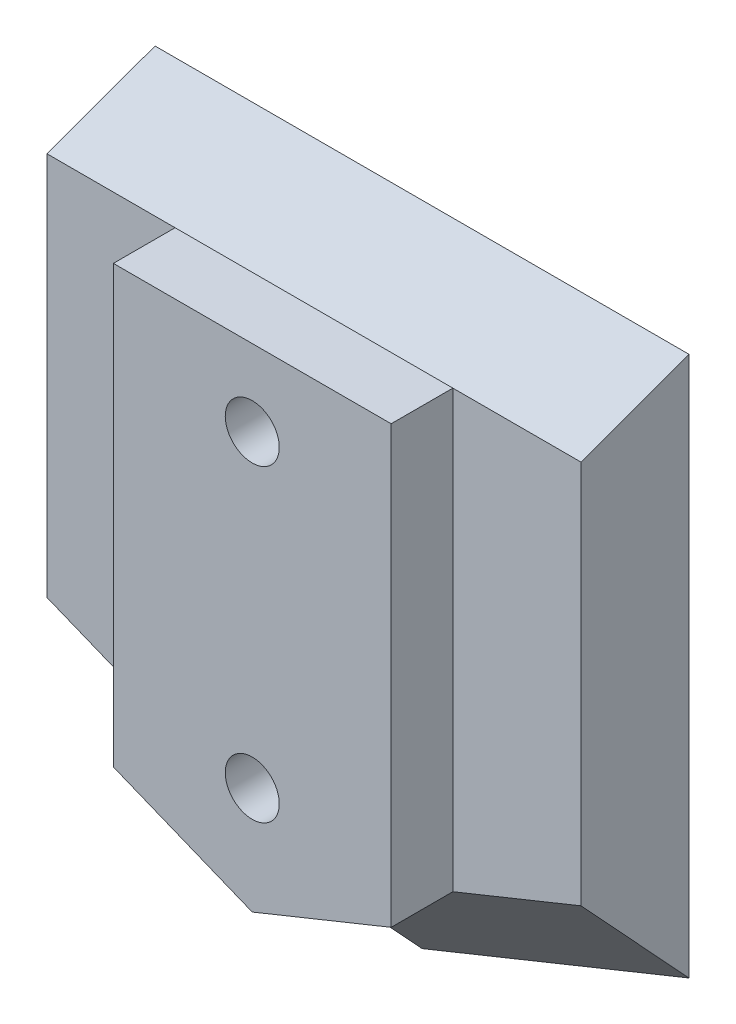
ISO-10303-21;
HEADER;
FILE_DESCRIPTION(('STEP AP214'),'2;1');
FILE_NAME('part.step','',(''),(''),'','','');
FILE_SCHEMA(('AUTOMOTIVE_DESIGN { 1 0 10303 214 1 1 1 1 }'));
ENDSEC;
DATA;
#1=APPLICATION_CONTEXT('core data for automotive mechanical design processes');
#2=APPLICATION_PROTOCOL_DEFINITION('international standard','automotive_design',2000,#1);
#3=PRODUCT_CONTEXT('',#1,'mechanical');
#4=PRODUCT('Part','Part','',(#3));
#5=PRODUCT_RELATED_PRODUCT_CATEGORY('part','',(#4));
#6=PRODUCT_DEFINITION_FORMATION('','',#4);
#7=PRODUCT_DEFINITION_CONTEXT('part definition',#1,'design');
#8=PRODUCT_DEFINITION('design','',#6,#7);
#9=PRODUCT_DEFINITION_SHAPE('','',#8);
#10=(LENGTH_UNIT() NAMED_UNIT(*) SI_UNIT(.MILLI.,.METRE.));
#11=(NAMED_UNIT(*) PLANE_ANGLE_UNIT() SI_UNIT($,.RADIAN.));
#12=(NAMED_UNIT(*) SI_UNIT($,.STERADIAN.) SOLID_ANGLE_UNIT());
#13=UNCERTAINTY_MEASURE_WITH_UNIT(LENGTH_MEASURE(1.E-05),#10,'distance_accuracy_value','');
#14=(GEOMETRIC_REPRESENTATION_CONTEXT(3) GLOBAL_UNCERTAINTY_ASSIGNED_CONTEXT((#13)) GLOBAL_UNIT_ASSIGNED_CONTEXT((#10,
#11,#12)) REPRESENTATION_CONTEXT('',''));
#15=CARTESIAN_POINT('',(0.,0.,0.));
#16=DIRECTION('',(0.,0.,1.));
#17=DIRECTION('',(1.,0.,0.));
#18=AXIS2_PLACEMENT_3D('',#15,#16,#17);
#19=CARTESIAN_POINT('',(0.,-12.,0.));
#20=DIRECTION('',(0.,0.,1.));
#21=DIRECTION('',(1.,0.,0.));
#22=AXIS2_PLACEMENT_3D('',#19,#20,#21);
#23=CYLINDRICAL_SURFACE('',#22,1.75);
#24=CARTESIAN_POINT('',(0.,-12.,11.));
#25=DIRECTION('',(0.,0.,1.));
#26=DIRECTION('',(-1.,0.,0.));
#27=AXIS2_PLACEMENT_3D('',#24,#25,#26);
#28=CIRCLE('',#27,1.75);
#29=CARTESIAN_POINT('',(-1.75,-12.,11.));
#30=VERTEX_POINT('',#29);
#31=EDGE_CURVE('E179',#30,#30,#28,.T.);
#32=ORIENTED_EDGE('',*,*,#31,.T.);
#33=EDGE_LOOP('',(#32));
#34=FACE_BOUND('',#33,.T.);
#35=CARTESIAN_POINT('',(0.,-12.,3.));
#36=DIRECTION('',(0.,0.,-1.));
#37=DIRECTION('',(-1.,0.,0.));
#38=AXIS2_PLACEMENT_3D('',#35,#36,#37);
#39=CIRCLE('',#38,1.75);
#40=CARTESIAN_POINT('',(-1.75,-12.,3.));
#41=VERTEX_POINT('',#40);
#42=EDGE_CURVE('E38',#41,#41,#39,.F.);
#43=ORIENTED_EDGE('',*,*,#42,.F.);
#44=EDGE_LOOP('',(#43));
#45=FACE_BOUND('',#44,.T.);
#46=ADVANCED_FACE('F34',(#34,#45),#23,.F.);
#47=CARTESIAN_POINT('',(0.,8.,0.));
#48=DIRECTION('',(0.,0.,1.));
#49=DIRECTION('',(1.,0.,0.));
#50=AXIS2_PLACEMENT_3D('',#47,#48,#49);
#51=CYLINDRICAL_SURFACE('',#50,1.75);
#52=CARTESIAN_POINT('',(0.,8.,11.));
#53=DIRECTION('',(0.,0.,1.));
#54=DIRECTION('',(-1.,0.,0.));
#55=AXIS2_PLACEMENT_3D('',#52,#53,#54);
#56=CIRCLE('',#55,1.75);
#57=CARTESIAN_POINT('',(-1.75,8.,11.));
#58=VERTEX_POINT('',#57);
#59=EDGE_CURVE('E174',#58,#58,#56,.T.);
#60=ORIENTED_EDGE('',*,*,#59,.T.);
#61=EDGE_LOOP('',(#60));
#62=FACE_BOUND('',#61,.T.);
#63=CARTESIAN_POINT('',(0.,8.,3.));
#64=DIRECTION('',(0.,0.,-1.));
#65=DIRECTION('',(-1.,0.,0.));
#66=AXIS2_PLACEMENT_3D('',#63,#64,#65);
#67=CIRCLE('',#66,1.75);
#68=CARTESIAN_POINT('',(-1.75,8.,3.));
#69=VERTEX_POINT('',#68);
#70=EDGE_CURVE('E172',#69,#69,#67,.F.);
#71=ORIENTED_EDGE('',*,*,#70,.F.);
#72=EDGE_LOOP('',(#71));
#73=FACE_BOUND('',#72,.T.);
#74=ADVANCED_FACE('F246',(#62,#73),#51,.F.);
#75=CARTESIAN_POINT('',(0.,0.,7.));
#76=DIRECTION('',(0.,0.,1.));
#77=DIRECTION('',(1.,0.,0.));
#78=AXIS2_PLACEMENT_3D('',#75,#76,#77);
#79=PLANE('',#78);
#80=DIRECTION('',(0.,-1.,0.));
#81=VECTOR('',#80,1.);
#82=CARTESIAN_POINT('',(-9.,12.9522083601366,7.));
#83=LINE('',#82,#81);
#84=CARTESIAN_POINT('',(-9.,12.9522083601366,7.));
#85=VERTEX_POINT('',#84);
#86=CARTESIAN_POINT('',(-9.,-15.3070690679913,7.));
#87=VERTEX_POINT('',#86);
#88=EDGE_CURVE('E203',#85,#87,#83,.T.);
#89=ORIENTED_EDGE('',*,*,#88,.F.);
#90=DIRECTION('',(-1.,0.,0.));
#91=VECTOR('',#90,1.);
#92=CARTESIAN_POINT('',(0.,12.9522083601366,7.));
#93=LINE('',#92,#91);
#94=CARTESIAN_POINT('',(-17.3,12.9522083601366,7.));
#95=VERTEX_POINT('',#94);
#96=EDGE_CURVE('E171',#85,#95,#93,.T.);
#97=ORIENTED_EDGE('',*,*,#96,.T.);
#98=DIRECTION('',(0.,-1.,0.));
#99=VECTOR('',#98,1.);
#100=CARTESIAN_POINT('',(-17.3,13.,7.));
#101=LINE('',#100,#99);
#102=CARTESIAN_POINT('',(-17.3,-11.9486875651011,7.));
#103=VERTEX_POINT('',#102);
#104=EDGE_CURVE('E154',#95,#103,#101,.T.);
#105=ORIENTED_EDGE('',*,*,#104,.T.);
#106=DIRECTION('',(0.926991176745522,-0.375083135099344,0.));
#107=VECTOR('',#106,1.);
#108=CARTESIAN_POINT('',(-6.5884351090578,-16.2828467695286,7.));
#109=LINE('',#108,#107);
#110=EDGE_CURVE('E157',#103,#87,#109,.T.);
#111=ORIENTED_EDGE('',*,*,#110,.T.);
#112=EDGE_LOOP('',(#89,#97,#105,#111));
#113=FACE_BOUND('',#112,.T.);
#114=ADVANCED_FACE('F226',(#113),#79,.T.);
#115=CARTESIAN_POINT('',(17.3,13.,7.));
#116=DIRECTION('',(-1.,0.,0.));
#117=DIRECTION('',(0.,0.,1.));
#118=AXIS2_PLACEMENT_3D('',#115,#116,#117);
#119=PLANE('',#118);
#120=DIRECTION('',(0.,1.,0.));
#121=VECTOR('',#120,1.);
#122=CARTESIAN_POINT('',(17.3,13.,0.));
#123=LINE('',#122,#121);
#124=CARTESIAN_POINT('',(17.3,-19.5,0.));
#125=VERTEX_POINT('',#124);
#126=CARTESIAN_POINT('',(17.3,15.5,0.));
#127=VERTEX_POINT('',#126);
#128=EDGE_CURVE('E150',#125,#127,#123,.T.);
#129=ORIENTED_EDGE('',*,*,#128,.T.);
#130=DIRECTION('',(0.,0.342020143325666,-0.939692620785909));
#131=VECTOR('',#130,1.);
#132=CARTESIAN_POINT('',(17.3,15.5,0.));
#133=LINE('',#132,#131);
#134=CARTESIAN_POINT('',(17.3,12.9522083601366,7.));
#135=VERTEX_POINT('',#134);
#136=EDGE_CURVE('E168',#127,#135,#133,.F.);
#137=ORIENTED_EDGE('',*,*,#136,.T.);
#138=DIRECTION('',(0.,1.,0.));
#139=VECTOR('',#138,1.);
#140=CARTESIAN_POINT('',(17.3,13.,7.));
#141=LINE('',#140,#139);
#142=CARTESIAN_POINT('',(17.3,-11.9486875651011,7.));
#143=VERTEX_POINT('',#142);
#144=EDGE_CURVE('E151',#143,#135,#141,.T.);
#145=ORIENTED_EDGE('',*,*,#144,.F.);
#146=DIRECTION('',(0.,0.733371095333155,0.679828534654032));
#147=VECTOR('',#146,1.);
#148=CARTESIAN_POINT('',(17.3,-19.5,0.));
#149=LINE('',#148,#147);
#150=EDGE_CURVE('E164',#143,#125,#149,.F.);
#151=ORIENTED_EDGE('',*,*,#150,.T.);
#152=EDGE_LOOP('',(#129,#137,#145,#151));
#153=FACE_BOUND('',#152,.T.);
#154=ADVANCED_FACE('F277',(#153),#119,.F.);
#155=CARTESIAN_POINT('',(-17.3,13.,7.));
#156=DIRECTION('',(1.,0.,0.));
#157=DIRECTION('',(0.,1.,0.));
#158=AXIS2_PLACEMENT_3D('',#155,#156,#157);
#159=PLANE('',#158);
#160=ORIENTED_EDGE('',*,*,#104,.F.);
#161=DIRECTION('',(0.,-0.342020143325666,0.939692620785909));
#162=VECTOR('',#161,1.);
#163=CARTESIAN_POINT('',(-17.3,15.5,0.));
#164=LINE('',#163,#162);
#165=CARTESIAN_POINT('',(-17.3,15.5,0.));
#166=VERTEX_POINT('',#165);
#167=EDGE_CURVE('E11',#95,#166,#164,.F.);
#168=ORIENTED_EDGE('',*,*,#167,.T.);
#169=DIRECTION('',(0.,-1.,0.));
#170=VECTOR('',#169,1.);
#171=CARTESIAN_POINT('',(-17.3,13.,0.));
#172=LINE('',#171,#170);
#173=CARTESIAN_POINT('',(-17.3,-19.5,0.));
#174=VERTEX_POINT('',#173);
#175=EDGE_CURVE('E155',#166,#174,#172,.T.);
#176=ORIENTED_EDGE('',*,*,#175,.T.);
#177=DIRECTION('',(0.,-0.733371095333155,-0.679828534654032));
#178=VECTOR('',#177,1.);
#179=CARTESIAN_POINT('',(-17.3,-23.2648321442911,-3.48996617968573));
#180=LINE('',#179,#178);
#181=EDGE_CURVE('E166',#174,#103,#180,.F.);
#182=ORIENTED_EDGE('',*,*,#181,.T.);
#183=EDGE_LOOP('',(#160,#168,#176,#182));
#184=FACE_BOUND('',#183,.T.);
#185=ADVANCED_FACE('F228',(#184),#159,.F.);
#186=DIRECTION('',(0.,1.,0.));
#187=VECTOR('',#186,1.);
#188=CARTESIAN_POINT('',(9.,-15.3070690679913,7.));
#189=LINE('',#188,#187);
#190=CARTESIAN_POINT('',(9.,-15.3070690679913,7.));
#191=VERTEX_POINT('',#190);
#192=CARTESIAN_POINT('',(9.,12.9522083601366,7.));
#193=VERTEX_POINT('',#192);
#194=EDGE_CURVE('E51',#191,#193,#189,.T.);
#195=ORIENTED_EDGE('',*,*,#194,.F.);
#196=DIRECTION('',(0.926991176745522,0.375083135099344,0.));
#197=VECTOR('',#196,1.);
#198=CARTESIAN_POINT('',(6.5884351090578,-16.2828467695286,7.));
#199=LINE('',#198,#197);
#200=EDGE_CURVE('E162',#191,#143,#199,.T.);
#201=ORIENTED_EDGE('',*,*,#200,.T.);
#202=ORIENTED_EDGE('',*,*,#144,.T.);
#203=EDGE_CURVE('E43',#135,#193,#93,.T.);
#204=ORIENTED_EDGE('',*,*,#203,.T.);
#205=EDGE_LOOP('',(#195,#201,#202,#204));
#206=FACE_BOUND('',#205,.T.);
#207=ADVANCED_FACE('F242',(#206),#79,.T.);
#208=CARTESIAN_POINT('',(0.,0.,0.));
#209=DIRECTION('',(0.,0.,1.));
#210=DIRECTION('',(1.,0.,0.));
#211=AXIS2_PLACEMENT_3D('',#208,#209,#210);
#212=PLANE('',#211);
#213=CARTESIAN_POINT('',(0.,-12.,0.));
#214=DIRECTION('',(0.,0.,-1.));
#215=DIRECTION('',(-1.,0.,0.));
#216=AXIS2_PLACEMENT_3D('',#213,#214,#215);
#217=CIRCLE('',#216,3.5);
#218=CARTESIAN_POINT('',(-3.5,-12.,0.));
#219=VERTEX_POINT('',#218);
#220=EDGE_CURVE('E189',#219,#219,#217,.T.);
#221=ORIENTED_EDGE('',*,*,#220,.F.);
#222=EDGE_LOOP('',(#221));
#223=FACE_BOUND('',#222,.T.);
#224=CARTESIAN_POINT('',(0.,8.,0.));
#225=DIRECTION('',(0.,0.,-1.));
#226=DIRECTION('',(-1.,0.,0.));
#227=AXIS2_PLACEMENT_3D('',#224,#225,#226);
#228=CIRCLE('',#227,3.5);
#229=CARTESIAN_POINT('',(-3.5,8.,0.));
#230=VERTEX_POINT('',#229);
#231=EDGE_CURVE('E182',#230,#230,#228,.T.);
#232=ORIENTED_EDGE('',*,*,#231,.F.);
#233=EDGE_LOOP('',(#232));
#234=FACE_BOUND('',#233,.T.);
#235=ORIENTED_EDGE('',*,*,#128,.F.);
#236=DIRECTION('',(-0.926991176745522,-0.375083135099344,0.));
#237=VECTOR('',#236,1.);
#238=CARTESIAN_POINT('',(17.3,-19.5,0.));
#239=LINE('',#238,#237);
#240=CARTESIAN_POINT('',(0.,-26.5,0.));
#241=VERTEX_POINT('',#240);
#242=EDGE_CURVE('E136',#125,#241,#239,.T.);
#243=ORIENTED_EDGE('',*,*,#242,.T.);
#244=DIRECTION('',(-0.926991176745522,0.375083135099344,0.));
#245=VECTOR('',#244,1.);
#246=CARTESIAN_POINT('',(0.,-26.5,0.));
#247=LINE('',#246,#245);
#248=EDGE_CURVE('E142',#241,#174,#247,.T.);
#249=ORIENTED_EDGE('',*,*,#248,.T.);
#250=ORIENTED_EDGE('',*,*,#175,.F.);
#251=DIRECTION('',(1.,0.,0.));
#252=VECTOR('',#251,1.);
#253=CARTESIAN_POINT('',(17.3,15.5,0.));
#254=LINE('',#253,#252);
#255=EDGE_CURVE('E145',#166,#127,#254,.T.);
#256=ORIENTED_EDGE('',*,*,#255,.T.);
#257=EDGE_LOOP('',(#235,#243,#249,#250,#256));
#258=FACE_BOUND('',#257,.T.);
#259=ADVANCED_FACE('F235',(#223,#234,#258),#212,.F.);
#260=CARTESIAN_POINT('',(0.,-26.5,0.));
#261=DIRECTION('',(0.265223828337456,0.655481747176855,-0.707106781186549));
#262=DIRECTION('',(-0.926991176745522,0.375083135099344,0.));
#263=AXIS2_PLACEMENT_3D('',#260,#261,#262);
#264=PLANE('',#263);
#265=ORIENTED_EDGE('',*,*,#181,.F.);
#266=ORIENTED_EDGE('',*,*,#248,.F.);
#267=DIRECTION('',(0.,0.733371095333155,0.679828534654032));
#268=VECTOR('',#267,1.);
#269=CARTESIAN_POINT('',(0.,-26.5,0.));
#270=LINE('',#269,#268);
#271=CARTESIAN_POINT('',(0.,-18.9486875651011,7.));
#272=VERTEX_POINT('',#271);
#273=EDGE_CURVE('E134',#272,#241,#270,.F.);
#274=ORIENTED_EDGE('',*,*,#273,.F.);
#275=DIRECTION('',(0.926991176745522,-0.375083135099345,0.));
#276=VECTOR('',#275,1.);
#277=CARTESIAN_POINT('',(-9.,-15.3070690679913,7.));
#278=LINE('',#277,#276);
#279=EDGE_CURVE('E59',#87,#272,#278,.T.);
#280=ORIENTED_EDGE('',*,*,#279,.F.);
#281=ORIENTED_EDGE('',*,*,#110,.F.);
#282=EDGE_LOOP('',(#265,#266,#274,#280,#281));
#283=FACE_BOUND('',#282,.T.);
#284=ADVANCED_FACE('F232',(#283),#264,.F.);
#285=CARTESIAN_POINT('',(17.3,-19.5,0.));
#286=DIRECTION('',(-0.265223828337456,0.655481747176855,-0.707106781186549));
#287=DIRECTION('',(-0.926991176745522,-0.375083135099344,0.));
#288=AXIS2_PLACEMENT_3D('',#285,#286,#287);
#289=PLANE('',#288);
#290=ORIENTED_EDGE('',*,*,#150,.F.);
#291=ORIENTED_EDGE('',*,*,#200,.F.);
#292=EDGE_CURVE('E133',#272,#191,#199,.T.);
#293=ORIENTED_EDGE('',*,*,#292,.F.);
#294=ORIENTED_EDGE('',*,*,#273,.T.);
#295=ORIENTED_EDGE('',*,*,#242,.F.);
#296=EDGE_LOOP('',(#290,#291,#293,#294,#295));
#297=FACE_BOUND('',#296,.T.);
#298=ADVANCED_FACE('F234',(#297),#289,.F.);
#299=CARTESIAN_POINT('',(17.3,15.5,0.));
#300=DIRECTION('',(0.,-0.939692620785909,-0.342020143325666));
#301=DIRECTION('',(1.,0.,0.));
#302=AXIS2_PLACEMENT_3D('',#299,#300,#301);
#303=PLANE('',#302);
#304=ORIENTED_EDGE('',*,*,#167,.F.);
#305=ORIENTED_EDGE('',*,*,#96,.F.);
#306=DIRECTION('',(-1.,0.,0.));
#307=VECTOR('',#306,1.);
#308=CARTESIAN_POINT('',(9.,12.9522083601366,7.));
#309=LINE('',#308,#307);
#310=EDGE_CURVE('E200',#193,#85,#309,.T.);
#311=ORIENTED_EDGE('',*,*,#310,.F.);
#312=ORIENTED_EDGE('',*,*,#203,.F.);
#313=ORIENTED_EDGE('',*,*,#136,.F.);
#314=ORIENTED_EDGE('',*,*,#255,.F.);
#315=EDGE_LOOP('',(#304,#305,#311,#312,#313,#314));
#316=FACE_BOUND('',#315,.T.);
#317=ADVANCED_FACE('F36',(#316),#303,.F.);
#318=CARTESIAN_POINT('',(0.,-18.9486875651011,11.));
#319=DIRECTION('',(-0.375083135099345,0.926991176745522,0.));
#320=DIRECTION('',(-0.926991176745522,-0.375083135099345,0.));
#321=AXIS2_PLACEMENT_3D('',#318,#319,#320);
#322=PLANE('',#321);
#323=ORIENTED_EDGE('',*,*,#292,.T.);
#324=DIRECTION('',(0.,0.,-1.));
#325=VECTOR('',#324,1.);
#326=CARTESIAN_POINT('',(9.,-15.3070690679913,11.));
#327=LINE('',#326,#325);
#328=CARTESIAN_POINT('',(9.,-15.3070690679913,11.));
#329=VERTEX_POINT('',#328);
#330=EDGE_CURVE('E115',#329,#191,#327,.T.);
#331=ORIENTED_EDGE('',*,*,#330,.F.);
#332=DIRECTION('',(0.926991176745522,0.375083135099345,0.));
#333=VECTOR('',#332,1.);
#334=CARTESIAN_POINT('',(0.,-18.9486875651011,11.));
#335=LINE('',#334,#333);
#336=CARTESIAN_POINT('',(0.,-18.9486875651011,11.));
#337=VERTEX_POINT('',#336);
#338=EDGE_CURVE('E122',#337,#329,#335,.T.);
#339=ORIENTED_EDGE('',*,*,#338,.F.);
#340=DIRECTION('',(0.,0.,-1.));
#341=VECTOR('',#340,1.);
#342=CARTESIAN_POINT('',(0.,-18.9486875651011,11.));
#343=LINE('',#342,#341);
#344=EDGE_CURVE('E198',#337,#272,#343,.T.);
#345=ORIENTED_EDGE('',*,*,#344,.T.);
#346=EDGE_LOOP('',(#323,#331,#339,#345));
#347=FACE_BOUND('',#346,.T.);
#348=ADVANCED_FACE('F132',(#347),#322,.F.);
#349=CARTESIAN_POINT('',(9.,-15.3070690679913,11.));
#350=DIRECTION('',(-1.,0.,0.));
#351=DIRECTION('',(0.,-1.,0.));
#352=AXIS2_PLACEMENT_3D('',#349,#350,#351);
#353=PLANE('',#352);
#354=ORIENTED_EDGE('',*,*,#194,.T.);
#355=DIRECTION('',(0.,0.,-1.));
#356=VECTOR('',#355,1.);
#357=CARTESIAN_POINT('',(9.,12.9522083601366,11.));
#358=LINE('',#357,#356);
#359=CARTESIAN_POINT('',(9.,12.9522083601366,11.));
#360=VERTEX_POINT('',#359);
#361=EDGE_CURVE('E118',#360,#193,#358,.T.);
#362=ORIENTED_EDGE('',*,*,#361,.F.);
#363=DIRECTION('',(0.,1.,0.));
#364=VECTOR('',#363,1.);
#365=CARTESIAN_POINT('',(9.,-15.3070690679913,11.));
#366=LINE('',#365,#364);
#367=EDGE_CURVE('E111',#329,#360,#366,.T.);
#368=ORIENTED_EDGE('',*,*,#367,.F.);
#369=ORIENTED_EDGE('',*,*,#330,.T.);
#370=EDGE_LOOP('',(#354,#362,#368,#369));
#371=FACE_BOUND('',#370,.T.);
#372=ADVANCED_FACE('F113',(#371),#353,.F.);
#373=CARTESIAN_POINT('',(9.,12.9522083601366,11.));
#374=DIRECTION('',(0.,-1.,0.));
#375=DIRECTION('',(0.,0.,-1.));
#376=AXIS2_PLACEMENT_3D('',#373,#374,#375);
#377=PLANE('',#376);
#378=ORIENTED_EDGE('',*,*,#310,.T.);
#379=DIRECTION('',(0.,0.,-1.));
#380=VECTOR('',#379,1.);
#381=CARTESIAN_POINT('',(-9.,12.9522083601366,11.));
#382=LINE('',#381,#380);
#383=CARTESIAN_POINT('',(-9.,12.9522083601366,11.));
#384=VERTEX_POINT('',#383);
#385=EDGE_CURVE('E138',#384,#85,#382,.T.);
#386=ORIENTED_EDGE('',*,*,#385,.F.);
#387=DIRECTION('',(-1.,0.,0.));
#388=VECTOR('',#387,1.);
#389=CARTESIAN_POINT('',(9.,12.9522083601366,11.));
#390=LINE('',#389,#388);
#391=EDGE_CURVE('E121',#360,#384,#390,.T.);
#392=ORIENTED_EDGE('',*,*,#391,.F.);
#393=ORIENTED_EDGE('',*,*,#361,.T.);
#394=EDGE_LOOP('',(#378,#386,#392,#393));
#395=FACE_BOUND('',#394,.T.);
#396=ADVANCED_FACE('F217',(#395),#377,.F.);
#397=CARTESIAN_POINT('',(-9.,12.9522083601366,11.));
#398=DIRECTION('',(1.,0.,0.));
#399=DIRECTION('',(0.,1.,0.));
#400=AXIS2_PLACEMENT_3D('',#397,#398,#399);
#401=PLANE('',#400);
#402=ORIENTED_EDGE('',*,*,#88,.T.);
#403=DIRECTION('',(0.,0.,-1.));
#404=VECTOR('',#403,1.);
#405=CARTESIAN_POINT('',(-9.,-15.3070690679913,11.));
#406=LINE('',#405,#404);
#407=CARTESIAN_POINT('',(-9.,-15.3070690679913,11.));
#408=VERTEX_POINT('',#407);
#409=EDGE_CURVE('E208',#408,#87,#406,.T.);
#410=ORIENTED_EDGE('',*,*,#409,.F.);
#411=DIRECTION('',(0.,-1.,0.));
#412=VECTOR('',#411,1.);
#413=CARTESIAN_POINT('',(-9.,12.9522083601366,11.));
#414=LINE('',#413,#412);
#415=EDGE_CURVE('E195',#384,#408,#414,.T.);
#416=ORIENTED_EDGE('',*,*,#415,.F.);
#417=ORIENTED_EDGE('',*,*,#385,.T.);
#418=EDGE_LOOP('',(#402,#410,#416,#417));
#419=FACE_BOUND('',#418,.T.);
#420=ADVANCED_FACE('F214',(#419),#401,.F.);
#421=CARTESIAN_POINT('',(-9.,-15.3070690679913,11.));
#422=DIRECTION('',(0.375083135099344,0.926991176745521,0.));
#423=DIRECTION('',(-0.926991176745522,0.375083135099345,0.));
#424=AXIS2_PLACEMENT_3D('',#421,#422,#423);
#425=PLANE('',#424);
#426=ORIENTED_EDGE('',*,*,#279,.T.);
#427=ORIENTED_EDGE('',*,*,#344,.F.);
#428=DIRECTION('',(0.926991176745522,-0.375083135099345,0.));
#429=VECTOR('',#428,1.);
#430=CARTESIAN_POINT('',(-9.,-15.3070690679913,11.));
#431=LINE('',#430,#429);
#432=EDGE_CURVE('E127',#408,#337,#431,.T.);
#433=ORIENTED_EDGE('',*,*,#432,.F.);
#434=ORIENTED_EDGE('',*,*,#409,.T.);
#435=EDGE_LOOP('',(#426,#427,#433,#434));
#436=FACE_BOUND('',#435,.T.);
#437=ADVANCED_FACE('F260',(#436),#425,.F.);
#438=CARTESIAN_POINT('',(0.,0.,11.));
#439=DIRECTION('',(0.,0.,1.));
#440=DIRECTION('',(1.,0.,0.));
#441=AXIS2_PLACEMENT_3D('',#438,#439,#440);
#442=PLANE('',#441);
#443=ORIENTED_EDGE('',*,*,#59,.F.);
#444=EDGE_LOOP('',(#443));
#445=FACE_BOUND('',#444,.T.);
#446=ORIENTED_EDGE('',*,*,#31,.F.);
#447=EDGE_LOOP('',(#446));
#448=FACE_BOUND('',#447,.T.);
#449=ORIENTED_EDGE('',*,*,#338,.T.);
#450=ORIENTED_EDGE('',*,*,#367,.T.);
#451=ORIENTED_EDGE('',*,*,#391,.T.);
#452=ORIENTED_EDGE('',*,*,#415,.T.);
#453=ORIENTED_EDGE('',*,*,#432,.T.);
#454=EDGE_LOOP('',(#449,#450,#451,#452,#453));
#455=FACE_BOUND('',#454,.T.);
#456=ADVANCED_FACE('F125',(#445,#448,#455),#442,.T.);
#457=CARTESIAN_POINT('',(0.,8.,3.));
#458=DIRECTION('',(0.,0.,-1.));
#459=DIRECTION('',(-1.,0.,0.));
#460=AXIS2_PLACEMENT_3D('',#457,#458,#459);
#461=PLANE('',#460);
#462=CARTESIAN_POINT('',(0.,8.,3.));
#463=DIRECTION('',(0.,0.,-1.));
#464=DIRECTION('',(-1.,0.,0.));
#465=AXIS2_PLACEMENT_3D('',#462,#463,#464);
#466=CIRCLE('',#465,3.5);
#467=CARTESIAN_POINT('',(-3.5,8.,3.));
#468=VERTEX_POINT('',#467);
#469=EDGE_CURVE('E175',#468,#468,#466,.T.);
#470=ORIENTED_EDGE('',*,*,#469,.T.);
#471=EDGE_LOOP('',(#470));
#472=FACE_BOUND('',#471,.T.);
#473=ORIENTED_EDGE('',*,*,#70,.T.);
#474=EDGE_LOOP('',(#473));
#475=FACE_BOUND('',#474,.T.);
#476=ADVANCED_FACE('F259',(#472,#475),#461,.T.);
#477=CARTESIAN_POINT('',(0.,8.,3.));
#478=DIRECTION('',(0.,0.,-1.));
#479=DIRECTION('',(-1.,0.,0.));
#480=AXIS2_PLACEMENT_3D('',#477,#478,#479);
#481=CYLINDRICAL_SURFACE('',#480,3.5);
#482=ORIENTED_EDGE('',*,*,#469,.F.);
#483=EDGE_LOOP('',(#482));
#484=FACE_BOUND('',#483,.T.);
#485=ORIENTED_EDGE('',*,*,#231,.T.);
#486=EDGE_LOOP('',(#485));
#487=FACE_BOUND('',#486,.T.);
#488=ADVANCED_FACE('F317',(#484,#487),#481,.F.);
#489=CARTESIAN_POINT('',(0.,-12.,3.));
#490=DIRECTION('',(0.,0.,-1.));
#491=DIRECTION('',(-1.,0.,0.));
#492=AXIS2_PLACEMENT_3D('',#489,#490,#491);
#493=PLANE('',#492);
#494=CARTESIAN_POINT('',(0.,-12.,3.));
#495=DIRECTION('',(0.,0.,-1.));
#496=DIRECTION('',(-1.,0.,0.));
#497=AXIS2_PLACEMENT_3D('',#494,#495,#496);
#498=CIRCLE('',#497,3.5);
#499=CARTESIAN_POINT('',(-3.5,-12.,3.));
#500=VERTEX_POINT('',#499);
#501=EDGE_CURVE('E352',#500,#500,#498,.T.);
#502=ORIENTED_EDGE('',*,*,#501,.T.);
#503=EDGE_LOOP('',(#502));
#504=FACE_BOUND('',#503,.T.);
#505=ORIENTED_EDGE('',*,*,#42,.T.);
#506=EDGE_LOOP('',(#505));
#507=FACE_BOUND('',#506,.T.);
#508=ADVANCED_FACE('F326',(#504,#507),#493,.T.);
#509=CARTESIAN_POINT('',(0.,-12.,3.));
#510=DIRECTION('',(0.,0.,-1.));
#511=DIRECTION('',(-1.,0.,0.));
#512=AXIS2_PLACEMENT_3D('',#509,#510,#511);
#513=CYLINDRICAL_SURFACE('',#512,3.5);
#514=ORIENTED_EDGE('',*,*,#501,.F.);
#515=EDGE_LOOP('',(#514));
#516=FACE_BOUND('',#515,.T.);
#517=ORIENTED_EDGE('',*,*,#220,.T.);
#518=EDGE_LOOP('',(#517));
#519=FACE_BOUND('',#518,.T.);
#520=ADVANCED_FACE('F335',(#516,#519),#513,.F.);
#521=CLOSED_SHELL('',(#46,#74,#114,#154,#185,#207,#259,#284,#298,#317,#348,#372,#396,#420,#437,
#456,#476,#488,#508,#520));
#522=MANIFOLD_SOLID_BREP('B2',#521);
#523=ADVANCED_BREP_SHAPE_REPRESENTATION('',(#18,#522),#14);
#524=SHAPE_DEFINITION_REPRESENTATION(#9,#523);
ENDSEC;
END-ISO-10303-21;
